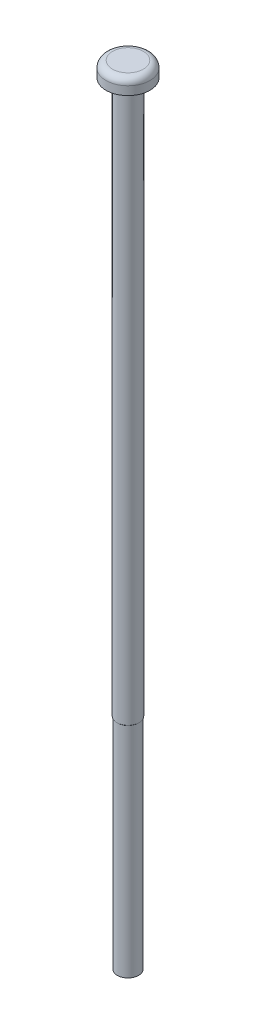
ISO-10303-21;
HEADER;
FILE_DESCRIPTION(('STEP AP214'),'2;1');
FILE_NAME('part.step','',(''),(''),'','','');
FILE_SCHEMA(('AUTOMOTIVE_DESIGN { 1 0 10303 214 1 1 1 1 }'));
ENDSEC;
DATA;
#1=APPLICATION_CONTEXT('core data for automotive mechanical design processes');
#2=APPLICATION_PROTOCOL_DEFINITION('international standard','automotive_design',2000,#1);
#3=PRODUCT_CONTEXT('',#1,'mechanical');
#4=PRODUCT('Part','Part','',(#3));
#5=PRODUCT_RELATED_PRODUCT_CATEGORY('part','',(#4));
#6=PRODUCT_DEFINITION_FORMATION('','',#4);
#7=PRODUCT_DEFINITION_CONTEXT('part definition',#1,'design');
#8=PRODUCT_DEFINITION('design','',#6,#7);
#9=PRODUCT_DEFINITION_SHAPE('','',#8);
#10=(LENGTH_UNIT() NAMED_UNIT(*) SI_UNIT(.MILLI.,.METRE.));
#11=(NAMED_UNIT(*) PLANE_ANGLE_UNIT() SI_UNIT($,.RADIAN.));
#12=(NAMED_UNIT(*) SI_UNIT($,.STERADIAN.) SOLID_ANGLE_UNIT());
#13=UNCERTAINTY_MEASURE_WITH_UNIT(LENGTH_MEASURE(1.E-05),#10,'distance_accuracy_value','');
#14=(GEOMETRIC_REPRESENTATION_CONTEXT(3) GLOBAL_UNCERTAINTY_ASSIGNED_CONTEXT((#13)) GLOBAL_UNIT_ASSIGNED_CONTEXT((#10,
#11,#12)) REPRESENTATION_CONTEXT('',''));
#15=CARTESIAN_POINT('',(0.,0.,0.));
#16=DIRECTION('',(0.,0.,1.));
#17=DIRECTION('',(1.,0.,0.));
#18=AXIS2_PLACEMENT_3D('',#15,#16,#17);
#19=CARTESIAN_POINT('',(0.,120.,0.));
#20=DIRECTION('',(0.,1.,0.));
#21=DIRECTION('',(-1.,0.,0.));
#22=AXIS2_PLACEMENT_3D('',#19,#20,#21);
#23=PLANE('',#22);
#24=CARTESIAN_POINT('',(0.,120.,0.));
#25=DIRECTION('',(0.,1.,0.));
#26=DIRECTION('',(-1.,0.,0.));
#27=AXIS2_PLACEMENT_3D('',#24,#25,#26);
#28=CIRCLE('',#27,2.35);
#29=CARTESIAN_POINT('',(-2.35,120.,0.));
#30=VERTEX_POINT('',#29);
#31=EDGE_CURVE('E68',#30,#30,#28,.T.);
#32=ORIENTED_EDGE('',*,*,#31,.T.);
#33=EDGE_LOOP('',(#32));
#34=FACE_BOUND('',#33,.T.);
#35=ADVANCED_FACE('F37',(#34),#23,.T.);
#36=CARTESIAN_POINT('',(-1.62960470877839,0.,0.));
#37=DIRECTION('',(0.,-1.,0.));
#38=DIRECTION('',(1.,0.,0.));
#39=AXIS2_PLACEMENT_3D('',#36,#37,#38);
#40=PLANE('',#39);
#41=CARTESIAN_POINT('',(0.,0.,0.));
#42=DIRECTION('',(0.,1.,0.));
#43=DIRECTION('',(-1.,0.,0.));
#44=AXIS2_PLACEMENT_3D('',#41,#42,#43);
#45=CIRCLE('',#44,1.62960470877839);
#46=CARTESIAN_POINT('',(-1.62960470877839,0.,0.));
#47=VERTEX_POINT('',#46);
#48=EDGE_CURVE('E10',#47,#47,#45,.T.);
#49=ORIENTED_EDGE('',*,*,#48,.F.);
#50=EDGE_LOOP('',(#49));
#51=FACE_BOUND('',#50,.T.);
#52=ADVANCED_FACE('F86',(#51),#40,.T.);
#53=CARTESIAN_POINT('',(0.,120.,0.));
#54=DIRECTION('',(0.,1.,0.));
#55=DIRECTION('',(-1.,0.,0.));
#56=AXIS2_PLACEMENT_3D('',#53,#54,#55);
#57=CYLINDRICAL_SURFACE('',#56,1.62960470877838);
#58=ORIENTED_EDGE('',*,*,#48,.T.);
#59=EDGE_LOOP('',(#58));
#60=FACE_BOUND('',#59,.T.);
#61=CARTESIAN_POINT('',(0.,33.3296047087784,0.));
#62=DIRECTION('',(0.,1.,0.));
#63=DIRECTION('',(-1.,0.,0.));
#64=AXIS2_PLACEMENT_3D('',#61,#62,#63);
#65=CIRCLE('',#64,1.62960470877837);
#66=CARTESIAN_POINT('',(-1.62960470877837,33.3296047087784,0.));
#67=VERTEX_POINT('',#66);
#68=EDGE_CURVE('E44',#67,#67,#65,.T.);
#69=ORIENTED_EDGE('',*,*,#68,.F.);
#70=EDGE_LOOP('',(#69));
#71=FACE_BOUND('',#70,.T.);
#72=ADVANCED_FACE('F90',(#60,#71),#57,.T.);
#73=CARTESIAN_POINT('',(0.,33.4,0.));
#74=DIRECTION('',(0.,1.,0.));
#75=DIRECTION('',(-1.,0.,0.));
#76=AXIS2_PLACEMENT_3D('',#73,#74,#75);
#77=CONICAL_SURFACE('',#76,1.69999999999999,0.785398163397439);
#78=ORIENTED_EDGE('',*,*,#68,.T.);
#79=EDGE_LOOP('',(#78));
#80=FACE_BOUND('',#79,.T.);
#81=CARTESIAN_POINT('',(0.,33.4,0.));
#82=DIRECTION('',(0.,1.,0.));
#83=DIRECTION('',(-1.,0.,0.));
#84=AXIS2_PLACEMENT_3D('',#81,#82,#83);
#85=CIRCLE('',#84,1.69999999999999);
#86=CARTESIAN_POINT('',(-1.69999999999999,33.4,0.));
#87=VERTEX_POINT('',#86);
#88=EDGE_CURVE('E49',#87,#87,#85,.T.);
#89=ORIENTED_EDGE('',*,*,#88,.F.);
#90=EDGE_LOOP('',(#89));
#91=FACE_BOUND('',#90,.T.);
#92=ADVANCED_FACE('F95',(#80,#91),#77,.T.);
#93=CARTESIAN_POINT('',(0.,120.,0.));
#94=DIRECTION('',(0.,1.,0.));
#95=DIRECTION('',(-1.,0.,0.));
#96=AXIS2_PLACEMENT_3D('',#93,#94,#95);
#97=CYLINDRICAL_SURFACE('',#96,1.69999999999999);
#98=ORIENTED_EDGE('',*,*,#88,.T.);
#99=EDGE_LOOP('',(#98));
#100=FACE_BOUND('',#99,.T.);
#101=CARTESIAN_POINT('',(0.,117.7,0.));
#102=DIRECTION('',(0.,1.,0.));
#103=DIRECTION('',(-1.,0.,0.));
#104=AXIS2_PLACEMENT_3D('',#101,#102,#103);
#105=CIRCLE('',#104,1.7);
#106=CARTESIAN_POINT('',(-1.7,117.7,0.));
#107=VERTEX_POINT('',#106);
#108=EDGE_CURVE('E54',#107,#107,#105,.T.);
#109=ORIENTED_EDGE('',*,*,#108,.F.);
#110=EDGE_LOOP('',(#109));
#111=FACE_BOUND('',#110,.T.);
#112=ADVANCED_FACE('F100',(#100,#111),#97,.T.);
#113=CARTESIAN_POINT('',(-3.35,117.7,0.));
#114=DIRECTION('',(0.,-1.,0.));
#115=DIRECTION('',(1.,0.,0.));
#116=AXIS2_PLACEMENT_3D('',#113,#114,#115);
#117=PLANE('',#116);
#118=ORIENTED_EDGE('',*,*,#108,.T.);
#119=EDGE_LOOP('',(#118));
#120=FACE_BOUND('',#119,.T.);
#121=CARTESIAN_POINT('',(0.,117.7,0.));
#122=DIRECTION('',(0.,1.,0.));
#123=DIRECTION('',(-1.,0.,0.));
#124=AXIS2_PLACEMENT_3D('',#121,#122,#123);
#125=CIRCLE('',#124,3.35);
#126=CARTESIAN_POINT('',(-3.35,117.7,0.));
#127=VERTEX_POINT('',#126);
#128=EDGE_CURVE('E60',#127,#127,#125,.T.);
#129=ORIENTED_EDGE('',*,*,#128,.F.);
#130=EDGE_LOOP('',(#129));
#131=FACE_BOUND('',#130,.T.);
#132=ADVANCED_FACE('F82',(#120,#131),#117,.T.);
#133=CARTESIAN_POINT('',(0.,120.,0.));
#134=DIRECTION('',(0.,1.,0.));
#135=DIRECTION('',(-1.,0.,0.));
#136=AXIS2_PLACEMENT_3D('',#133,#134,#135);
#137=CYLINDRICAL_SURFACE('',#136,3.35);
#138=ORIENTED_EDGE('',*,*,#128,.T.);
#139=EDGE_LOOP('',(#138));
#140=FACE_BOUND('',#139,.T.);
#141=CARTESIAN_POINT('',(0.,119.,0.));
#142=DIRECTION('',(0.,1.,0.));
#143=DIRECTION('',(-1.,0.,0.));
#144=AXIS2_PLACEMENT_3D('',#141,#142,#143);
#145=CIRCLE('',#144,3.35);
#146=CARTESIAN_POINT('',(-3.35,119.,0.));
#147=VERTEX_POINT('',#146);
#148=EDGE_CURVE('E64',#147,#147,#145,.T.);
#149=ORIENTED_EDGE('',*,*,#148,.F.);
#150=EDGE_LOOP('',(#149));
#151=FACE_BOUND('',#150,.T.);
#152=ADVANCED_FACE('F76',(#140,#151),#137,.T.);
#153=CARTESIAN_POINT('',(0.,119.,0.));
#154=DIRECTION('',(0.,1.,0.));
#155=DIRECTION('',(-1.,0.,0.));
#156=AXIS2_PLACEMENT_3D('',#153,#154,#155);
#157=TOROIDAL_SURFACE('',#156,2.35,1.);
#158=ORIENTED_EDGE('',*,*,#148,.T.);
#159=EDGE_LOOP('',(#158));
#160=FACE_BOUND('',#159,.T.);
#161=ORIENTED_EDGE('',*,*,#31,.F.);
#162=EDGE_LOOP('',(#161));
#163=FACE_BOUND('',#162,.T.);
#164=ADVANCED_FACE('F74',(#160,#163),#157,.T.);
#165=CLOSED_SHELL('',(#35,#52,#72,#92,#112,#132,#152,#164));
#166=MANIFOLD_SOLID_BREP('B2',#165);
#167=ADVANCED_BREP_SHAPE_REPRESENTATION('',(#18,#166),#14);
#168=SHAPE_DEFINITION_REPRESENTATION(#9,#167);
ENDSEC;
END-ISO-10303-21;
